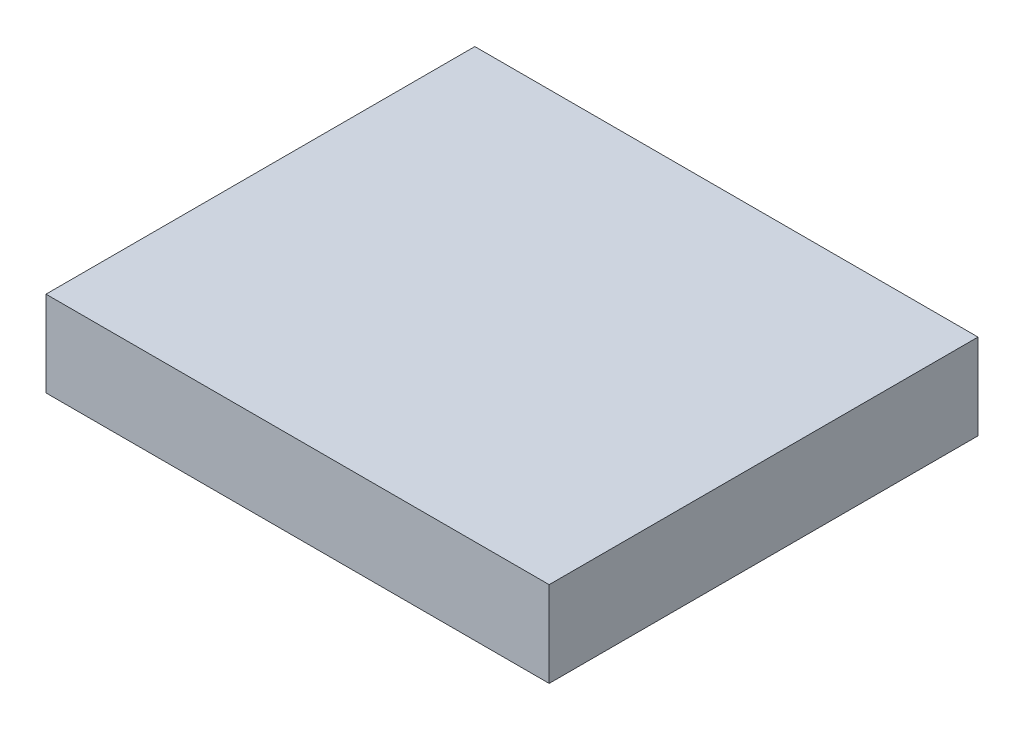
ISO-10303-21;
HEADER;
FILE_DESCRIPTION(('STEP AP214'),'2;1');
FILE_NAME('part.step','',(''),(''),'','','');
FILE_SCHEMA(('AUTOMOTIVE_DESIGN { 1 0 10303 214 1 1 1 1 }'));
ENDSEC;
DATA;
#1=APPLICATION_CONTEXT('core data for automotive mechanical design processes');
#2=APPLICATION_PROTOCOL_DEFINITION('international standard','automotive_design',2000,#1);
#3=PRODUCT_CONTEXT('',#1,'mechanical');
#4=PRODUCT('Part','Part','',(#3));
#5=PRODUCT_RELATED_PRODUCT_CATEGORY('part','',(#4));
#6=PRODUCT_DEFINITION_FORMATION('','',#4);
#7=PRODUCT_DEFINITION_CONTEXT('part definition',#1,'design');
#8=PRODUCT_DEFINITION('design','',#6,#7);
#9=PRODUCT_DEFINITION_SHAPE('','',#8);
#10=(LENGTH_UNIT() NAMED_UNIT(*) SI_UNIT(.MILLI.,.METRE.));
#11=(NAMED_UNIT(*) PLANE_ANGLE_UNIT() SI_UNIT($,.RADIAN.));
#12=(NAMED_UNIT(*) SI_UNIT($,.STERADIAN.) SOLID_ANGLE_UNIT());
#13=UNCERTAINTY_MEASURE_WITH_UNIT(LENGTH_MEASURE(1.E-05),#10,'distance_accuracy_value','');
#14=(GEOMETRIC_REPRESENTATION_CONTEXT(3) GLOBAL_UNCERTAINTY_ASSIGNED_CONTEXT((#13)) GLOBAL_UNIT_ASSIGNED_CONTEXT((#10,
#11,#12)) REPRESENTATION_CONTEXT('',''));
#15=CARTESIAN_POINT('',(0.,0.,0.));
#16=DIRECTION('',(0.,0.,1.));
#17=DIRECTION('',(1.,0.,0.));
#18=AXIS2_PLACEMENT_3D('',#15,#16,#17);
#19=CARTESIAN_POINT('',(0.,10.,0.));
#20=DIRECTION('',(1.,0.,0.));
#21=DIRECTION('',(0.,0.,-1.));
#22=AXIS2_PLACEMENT_3D('',#19,#20,#21);
#23=PLANE('',#22);
#24=DIRECTION('',(0.,0.,1.));
#25=VECTOR('',#24,1.);
#26=CARTESIAN_POINT('',(0.,0.,0.));
#27=LINE('',#26,#25);
#28=CARTESIAN_POINT('',(0.,0.,-50.1175439208623));
#29=VERTEX_POINT('',#28);
#30=CARTESIAN_POINT('',(0.,0.,0.));
#31=VERTEX_POINT('',#30);
#32=EDGE_CURVE('E98',#29,#31,#27,.T.);
#33=ORIENTED_EDGE('',*,*,#32,.T.);
#34=DIRECTION('',(0.,-1.,0.));
#35=VECTOR('',#34,1.);
#36=CARTESIAN_POINT('',(0.,10.,0.));
#37=LINE('',#36,#35);
#38=CARTESIAN_POINT('',(0.,10.,0.));
#39=VERTEX_POINT('',#38);
#40=EDGE_CURVE('E11',#39,#31,#37,.T.);
#41=ORIENTED_EDGE('',*,*,#40,.F.);
#42=DIRECTION('',(0.,0.,1.));
#43=VECTOR('',#42,1.);
#44=CARTESIAN_POINT('',(0.,10.,0.));
#45=LINE('',#44,#43);
#46=CARTESIAN_POINT('',(0.,10.,-50.1175439208623));
#47=VERTEX_POINT('',#46);
#48=EDGE_CURVE('E86',#47,#39,#45,.T.);
#49=ORIENTED_EDGE('',*,*,#48,.F.);
#50=DIRECTION('',(0.,-1.,0.));
#51=VECTOR('',#50,1.);
#52=CARTESIAN_POINT('',(0.,10.,-50.1175439208623));
#53=LINE('',#52,#51);
#54=EDGE_CURVE('E94',#47,#29,#53,.T.);
#55=ORIENTED_EDGE('',*,*,#54,.T.);
#56=EDGE_LOOP('',(#33,#41,#49,#55));
#57=FACE_BOUND('',#56,.T.);
#58=ADVANCED_FACE('F35',(#57),#23,.F.);
#59=CARTESIAN_POINT('',(0.,10.,0.));
#60=DIRECTION('',(0.,0.,-1.));
#61=DIRECTION('',(-1.,0.,0.));
#62=AXIS2_PLACEMENT_3D('',#59,#60,#61);
#63=PLANE('',#62);
#64=DIRECTION('',(1.,0.,0.));
#65=VECTOR('',#64,1.);
#66=CARTESIAN_POINT('',(0.,0.,0.));
#67=LINE('',#66,#65);
#68=CARTESIAN_POINT('',(58.8037156178416,0.,0.));
#69=VERTEX_POINT('',#68);
#70=EDGE_CURVE('E90',#31,#69,#67,.T.);
#71=ORIENTED_EDGE('',*,*,#70,.T.);
#72=DIRECTION('',(0.,-1.,0.));
#73=VECTOR('',#72,1.);
#74=CARTESIAN_POINT('',(58.8037156178416,10.,0.));
#75=LINE('',#74,#73);
#76=CARTESIAN_POINT('',(58.8037156178416,10.,0.));
#77=VERTEX_POINT('',#76);
#78=EDGE_CURVE('E43',#77,#69,#75,.T.);
#79=ORIENTED_EDGE('',*,*,#78,.F.);
#80=DIRECTION('',(1.,0.,0.));
#81=VECTOR('',#80,1.);
#82=CARTESIAN_POINT('',(0.,10.,0.));
#83=LINE('',#82,#81);
#84=EDGE_CURVE('E81',#39,#77,#83,.T.);
#85=ORIENTED_EDGE('',*,*,#84,.F.);
#86=ORIENTED_EDGE('',*,*,#40,.T.);
#87=EDGE_LOOP('',(#71,#79,#85,#86));
#88=FACE_BOUND('',#87,.T.);
#89=ADVANCED_FACE('F89',(#88),#63,.F.);
#90=CARTESIAN_POINT('',(58.8037156178416,10.,0.));
#91=DIRECTION('',(-1.,0.,0.));
#92=DIRECTION('',(0.,0.,1.));
#93=AXIS2_PLACEMENT_3D('',#90,#91,#92);
#94=PLANE('',#93);
#95=DIRECTION('',(0.,0.,-1.));
#96=VECTOR('',#95,1.);
#97=CARTESIAN_POINT('',(58.8037156178416,0.,0.));
#98=LINE('',#97,#96);
#99=CARTESIAN_POINT('',(58.8037156178416,0.,-50.1175439208623));
#100=VERTEX_POINT('',#99);
#101=EDGE_CURVE('E68',#69,#100,#98,.T.);
#102=ORIENTED_EDGE('',*,*,#101,.T.);
#103=DIRECTION('',(0.,-1.,0.));
#104=VECTOR('',#103,1.);
#105=CARTESIAN_POINT('',(58.8037156178416,10.,-50.1175439208623));
#106=LINE('',#105,#104);
#107=CARTESIAN_POINT('',(58.8037156178416,10.,-50.1175439208623));
#108=VERTEX_POINT('',#107);
#109=EDGE_CURVE('E91',#108,#100,#106,.T.);
#110=ORIENTED_EDGE('',*,*,#109,.F.);
#111=DIRECTION('',(0.,0.,-1.));
#112=VECTOR('',#111,1.);
#113=CARTESIAN_POINT('',(58.8037156178416,10.,0.));
#114=LINE('',#113,#112);
#115=EDGE_CURVE('E84',#77,#108,#114,.T.);
#116=ORIENTED_EDGE('',*,*,#115,.F.);
#117=ORIENTED_EDGE('',*,*,#78,.T.);
#118=EDGE_LOOP('',(#102,#110,#116,#117));
#119=FACE_BOUND('',#118,.T.);
#120=ADVANCED_FACE('F92',(#119),#94,.F.);
#121=CARTESIAN_POINT('',(0.,10.,-50.1175439208623));
#122=DIRECTION('',(0.,0.,1.));
#123=DIRECTION('',(1.,0.,0.));
#124=AXIS2_PLACEMENT_3D('',#121,#122,#123);
#125=PLANE('',#124);
#126=DIRECTION('',(-1.,0.,0.));
#127=VECTOR('',#126,1.);
#128=CARTESIAN_POINT('',(0.,0.,-50.1175439208623));
#129=LINE('',#128,#127);
#130=EDGE_CURVE('E74',#100,#29,#129,.T.);
#131=ORIENTED_EDGE('',*,*,#130,.T.);
#132=ORIENTED_EDGE('',*,*,#54,.F.);
#133=DIRECTION('',(-1.,0.,0.));
#134=VECTOR('',#133,1.);
#135=CARTESIAN_POINT('',(0.,10.,-50.1175439208623));
#136=LINE('',#135,#134);
#137=EDGE_CURVE('E51',#108,#47,#136,.T.);
#138=ORIENTED_EDGE('',*,*,#137,.F.);
#139=ORIENTED_EDGE('',*,*,#109,.T.);
#140=EDGE_LOOP('',(#131,#132,#138,#139));
#141=FACE_BOUND('',#140,.T.);
#142=ADVANCED_FACE('F105',(#141),#125,.F.);
#143=CARTESIAN_POINT('',(0.,10.,0.));
#144=DIRECTION('',(0.,-1.,0.));
#145=DIRECTION('',(0.,0.,-1.));
#146=AXIS2_PLACEMENT_3D('',#143,#144,#145);
#147=PLANE('',#146);
#148=ORIENTED_EDGE('',*,*,#48,.T.);
#149=ORIENTED_EDGE('',*,*,#84,.T.);
#150=ORIENTED_EDGE('',*,*,#115,.T.);
#151=ORIENTED_EDGE('',*,*,#137,.T.);
#152=EDGE_LOOP('',(#148,#149,#150,#151));
#153=FACE_BOUND('',#152,.T.);
#154=ADVANCED_FACE('F82',(#153),#147,.F.);
#155=CARTESIAN_POINT('',(0.,0.,0.));
#156=DIRECTION('',(0.,-1.,0.));
#157=DIRECTION('',(0.,0.,-1.));
#158=AXIS2_PLACEMENT_3D('',#155,#156,#157);
#159=PLANE('',#158);
#160=ORIENTED_EDGE('',*,*,#32,.F.);
#161=ORIENTED_EDGE('',*,*,#130,.F.);
#162=ORIENTED_EDGE('',*,*,#101,.F.);
#163=ORIENTED_EDGE('',*,*,#70,.F.);
#164=EDGE_LOOP('',(#160,#161,#162,#163));
#165=FACE_BOUND('',#164,.T.);
#166=ADVANCED_FACE('F108',(#165),#159,.T.);
#167=CLOSED_SHELL('',(#58,#89,#120,#142,#154,#166));
#168=MANIFOLD_SOLID_BREP('B2',#167);
#169=ADVANCED_BREP_SHAPE_REPRESENTATION('',(#18,#168),#14);
#170=SHAPE_DEFINITION_REPRESENTATION(#9,#169);
ENDSEC;
END-ISO-10303-21;
